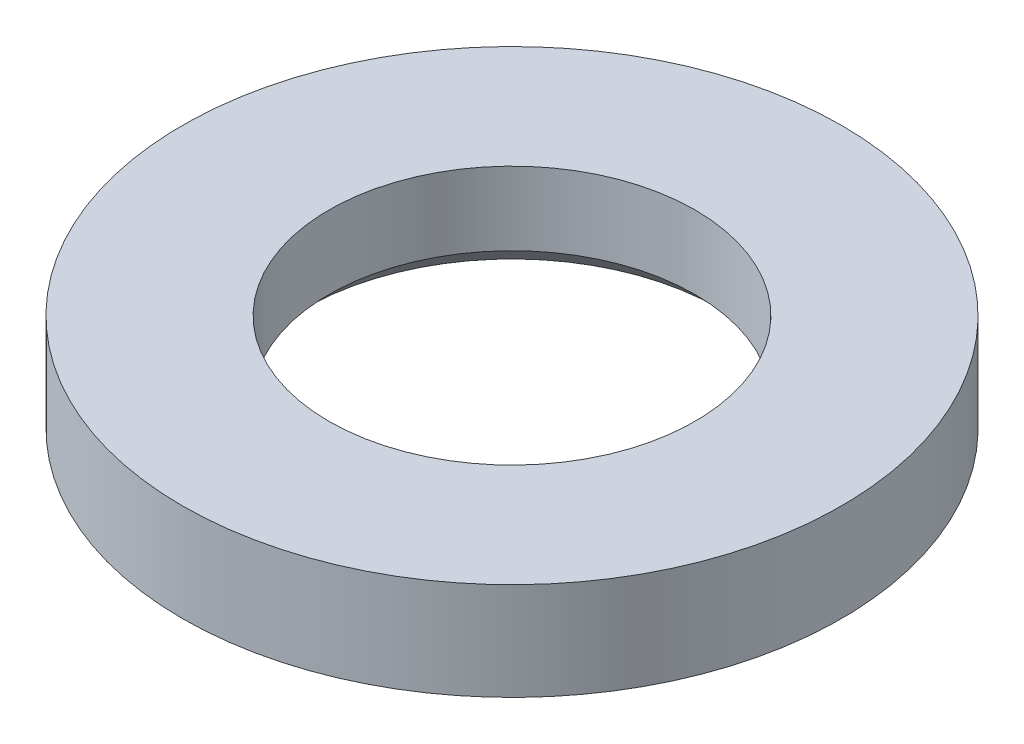
ISO-10303-21;
HEADER;
FILE_DESCRIPTION(('STEP AP214'),'2;1');
FILE_NAME('part.step','',(''),(''),'','','');
FILE_SCHEMA(('AUTOMOTIVE_DESIGN { 1 0 10303 214 1 1 1 1 }'));
ENDSEC;
DATA;
#1=APPLICATION_CONTEXT('core data for automotive mechanical design processes');
#2=APPLICATION_PROTOCOL_DEFINITION('international standard','automotive_design',2000,#1);
#3=PRODUCT_CONTEXT('',#1,'mechanical');
#4=PRODUCT('Part','Part','',(#3));
#5=PRODUCT_RELATED_PRODUCT_CATEGORY('part','',(#4));
#6=PRODUCT_DEFINITION_FORMATION('','',#4);
#7=PRODUCT_DEFINITION_CONTEXT('part definition',#1,'design');
#8=PRODUCT_DEFINITION('design','',#6,#7);
#9=PRODUCT_DEFINITION_SHAPE('','',#8);
#10=(LENGTH_UNIT() NAMED_UNIT(*) SI_UNIT(.MILLI.,.METRE.));
#11=(NAMED_UNIT(*) PLANE_ANGLE_UNIT() SI_UNIT($,.RADIAN.));
#12=(NAMED_UNIT(*) SI_UNIT($,.STERADIAN.) SOLID_ANGLE_UNIT());
#13=UNCERTAINTY_MEASURE_WITH_UNIT(LENGTH_MEASURE(1.E-05),#10,'distance_accuracy_value','');
#14=(GEOMETRIC_REPRESENTATION_CONTEXT(3) GLOBAL_UNCERTAINTY_ASSIGNED_CONTEXT((#13)) GLOBAL_UNIT_ASSIGNED_CONTEXT((#10,
#11,#12)) REPRESENTATION_CONTEXT('',''));
#15=CARTESIAN_POINT('',(0.,0.,0.));
#16=DIRECTION('',(0.,0.,1.));
#17=DIRECTION('',(1.,0.,0.));
#18=AXIS2_PLACEMENT_3D('',#15,#16,#17);
#19=CARTESIAN_POINT('',(0.,0.,0.));
#20=DIRECTION('',(0.,-1.,0.));
#21=DIRECTION('',(0.,0.,-1.));
#22=AXIS2_PLACEMENT_3D('',#19,#20,#21);
#23=CYLINDRICAL_SURFACE('',#22,1.5);
#24=CARTESIAN_POINT('',(0.,0.2,0.));
#25=DIRECTION('',(0.,-1.,0.));
#26=DIRECTION('',(0.,0.,-1.));
#27=AXIS2_PLACEMENT_3D('',#24,#25,#26);
#28=CIRCLE('',#27,1.5);
#29=CARTESIAN_POINT('',(0.,0.2,-1.5));
#30=VERTEX_POINT('',#29);
#31=EDGE_CURVE('E54',#30,#30,#28,.T.);
#32=ORIENTED_EDGE('',*,*,#31,.T.);
#33=EDGE_LOOP('',(#32));
#34=FACE_BOUND('',#33,.T.);
#35=CARTESIAN_POINT('',(0.,0.8,0.));
#36=DIRECTION('',(0.,-1.,0.));
#37=DIRECTION('',(0.,0.,-1.));
#38=AXIS2_PLACEMENT_3D('',#35,#36,#37);
#39=CIRCLE('',#38,1.5);
#40=CARTESIAN_POINT('',(0.,0.8,-1.5));
#41=VERTEX_POINT('',#40);
#42=EDGE_CURVE('E70',#41,#41,#39,.T.);
#43=ORIENTED_EDGE('',*,*,#42,.F.);
#44=EDGE_LOOP('',(#43));
#45=FACE_BOUND('',#44,.T.);
#46=ADVANCED_FACE('F45',(#34,#45),#23,.F.);
#47=CARTESIAN_POINT('',(1.5,0.,0.));
#48=DIRECTION('',(0.,-1.,0.));
#49=DIRECTION('',(0.,0.,-1.));
#50=AXIS2_PLACEMENT_3D('',#47,#48,#49);
#51=PLANE('',#50);
#52=CARTESIAN_POINT('',(0.,0.,0.));
#53=DIRECTION('',(0.,-1.,0.));
#54=DIRECTION('',(0.,0.,-1.));
#55=AXIS2_PLACEMENT_3D('',#52,#53,#54);
#56=CIRCLE('',#55,1.7);
#57=CARTESIAN_POINT('',(0.,0.,-1.7));
#58=VERTEX_POINT('',#57);
#59=EDGE_CURVE('E10',#58,#58,#56,.F.);
#60=ORIENTED_EDGE('',*,*,#59,.T.);
#61=EDGE_LOOP('',(#60));
#62=FACE_BOUND('',#61,.T.);
#63=CARTESIAN_POINT('',(0.,0.,0.));
#64=DIRECTION('',(0.,-1.,0.));
#65=DIRECTION('',(0.,0.,-1.));
#66=AXIS2_PLACEMENT_3D('',#63,#64,#65);
#67=CIRCLE('',#66,2.7);
#68=CARTESIAN_POINT('',(0.,0.,-2.7));
#69=VERTEX_POINT('',#68);
#70=EDGE_CURVE('E59',#69,#69,#67,.T.);
#71=ORIENTED_EDGE('',*,*,#70,.T.);
#72=EDGE_LOOP('',(#71));
#73=FACE_BOUND('',#72,.T.);
#74=ADVANCED_FACE('F79',(#62,#73),#51,.T.);
#75=CARTESIAN_POINT('',(0.,0.,0.));
#76=DIRECTION('',(0.,-1.,0.));
#77=DIRECTION('',(0.,0.,-1.));
#78=AXIS2_PLACEMENT_3D('',#75,#76,#77);
#79=CYLINDRICAL_SURFACE('',#78,2.7);
#80=CARTESIAN_POINT('',(0.,0.8,0.));
#81=DIRECTION('',(0.,-1.,0.));
#82=DIRECTION('',(0.,0.,-1.));
#83=AXIS2_PLACEMENT_3D('',#80,#81,#82);
#84=CIRCLE('',#83,2.7);
#85=CARTESIAN_POINT('',(0.,0.8,-2.7));
#86=VERTEX_POINT('',#85);
#87=EDGE_CURVE('E64',#86,#86,#84,.T.);
#88=ORIENTED_EDGE('',*,*,#87,.T.);
#89=EDGE_LOOP('',(#88));
#90=FACE_BOUND('',#89,.T.);
#91=ORIENTED_EDGE('',*,*,#70,.F.);
#92=EDGE_LOOP('',(#91));
#93=FACE_BOUND('',#92,.T.);
#94=ADVANCED_FACE('F84',(#90,#93),#79,.T.);
#95=CARTESIAN_POINT('',(2.7,0.8,0.));
#96=DIRECTION('',(0.,1.,0.));
#97=DIRECTION('',(0.,0.,1.));
#98=AXIS2_PLACEMENT_3D('',#95,#96,#97);
#99=PLANE('',#98);
#100=ORIENTED_EDGE('',*,*,#42,.T.);
#101=EDGE_LOOP('',(#100));
#102=FACE_BOUND('',#101,.T.);
#103=ORIENTED_EDGE('',*,*,#87,.F.);
#104=EDGE_LOOP('',(#103));
#105=FACE_BOUND('',#104,.T.);
#106=ADVANCED_FACE('F75',(#102,#105),#99,.T.);
#107=CARTESIAN_POINT('',(0.,0.2,0.));
#108=DIRECTION('',(0.,-1.,0.));
#109=DIRECTION('',(0.,0.,-1.));
#110=AXIS2_PLACEMENT_3D('',#107,#108,#109);
#111=CONICAL_SURFACE('',#110,1.5,0.785398163397449);
#112=ORIENTED_EDGE('',*,*,#59,.F.);
#113=EDGE_LOOP('',(#112));
#114=FACE_BOUND('',#113,.T.);
#115=ORIENTED_EDGE('',*,*,#31,.F.);
#116=EDGE_LOOP('',(#115));
#117=FACE_BOUND('',#116,.T.);
#118=ADVANCED_FACE('F48',(#114,#117),#111,.F.);
#119=CLOSED_SHELL('',(#46,#74,#94,#106,#118));
#120=MANIFOLD_SOLID_BREP('B2',#119);
#121=ADVANCED_BREP_SHAPE_REPRESENTATION('',(#18,#120),#14);
#122=SHAPE_DEFINITION_REPRESENTATION(#9,#121);
ENDSEC;
END-ISO-10303-21;
